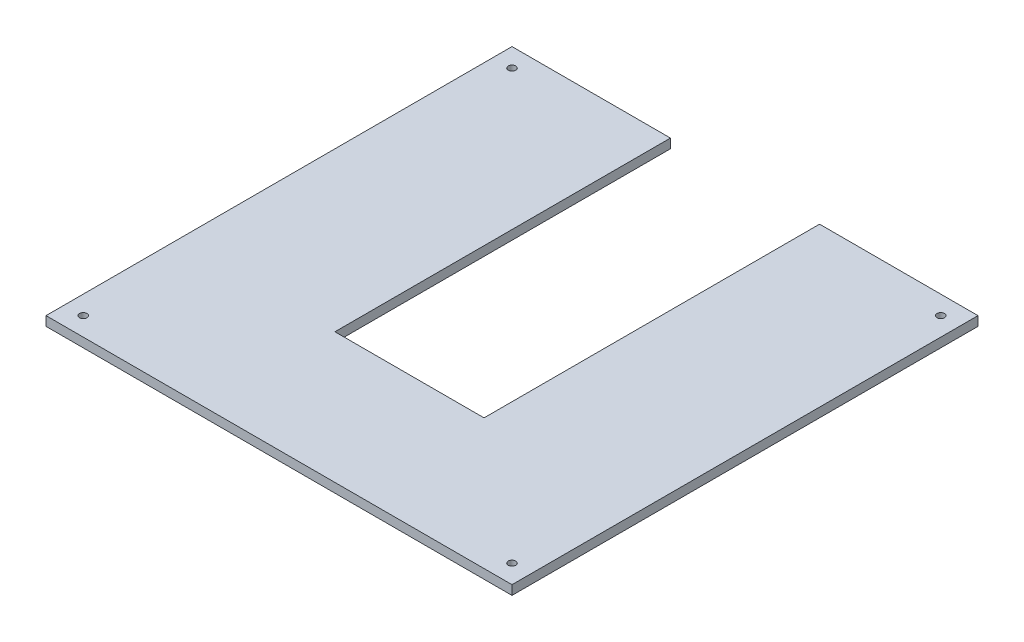
ISO-10303-21;
HEADER;
FILE_DESCRIPTION(('STEP AP214'),'2;1');
FILE_NAME('part.step','',(''),(''),'','','');
FILE_SCHEMA(('AUTOMOTIVE_DESIGN { 1 0 10303 214 1 1 1 1 }'));
ENDSEC;
DATA;
#1=APPLICATION_CONTEXT('core data for automotive mechanical design processes');
#2=APPLICATION_PROTOCOL_DEFINITION('international standard','automotive_design',2000,#1);
#3=PRODUCT_CONTEXT('',#1,'mechanical');
#4=PRODUCT('Part','Part','',(#3));
#5=PRODUCT_RELATED_PRODUCT_CATEGORY('part','',(#4));
#6=PRODUCT_DEFINITION_FORMATION('','',#4);
#7=PRODUCT_DEFINITION_CONTEXT('part definition',#1,'design');
#8=PRODUCT_DEFINITION('design','',#6,#7);
#9=PRODUCT_DEFINITION_SHAPE('','',#8);
#10=(LENGTH_UNIT() NAMED_UNIT(*) SI_UNIT(.MILLI.,.METRE.));
#11=(NAMED_UNIT(*) PLANE_ANGLE_UNIT() SI_UNIT($,.RADIAN.));
#12=(NAMED_UNIT(*) SI_UNIT($,.STERADIAN.) SOLID_ANGLE_UNIT());
#13=UNCERTAINTY_MEASURE_WITH_UNIT(LENGTH_MEASURE(1.E-05),#10,'distance_accuracy_value','');
#14=(GEOMETRIC_REPRESENTATION_CONTEXT(3) GLOBAL_UNCERTAINTY_ASSIGNED_CONTEXT((#13)) GLOBAL_UNIT_ASSIGNED_CONTEXT((#10,
#11,#12)) REPRESENTATION_CONTEXT('',''));
#15=CARTESIAN_POINT('',(0.,0.,0.));
#16=DIRECTION('',(0.,0.,1.));
#17=DIRECTION('',(1.,0.,0.));
#18=AXIS2_PLACEMENT_3D('',#15,#16,#17);
#19=CARTESIAN_POINT('',(0.,5.,0.));
#20=DIRECTION('',(0.,1.,0.));
#21=DIRECTION('',(0.,0.,1.));
#22=AXIS2_PLACEMENT_3D('',#19,#20,#21);
#23=PLANE('',#22);
#24=CARTESIAN_POINT('',(-115.,5.,115.));
#25=DIRECTION('',(0.,1.,0.));
#26=DIRECTION('',(0.,0.,-1.));
#27=AXIS2_PLACEMENT_3D('',#24,#25,#26);
#28=CIRCLE('',#27,2.);
#29=CARTESIAN_POINT('',(-115.,5.,113.));
#30=VERTEX_POINT('',#29);
#31=EDGE_CURVE('E187',#30,#30,#28,.T.);
#32=ORIENTED_EDGE('',*,*,#31,.F.);
#33=EDGE_LOOP('',(#32));
#34=FACE_BOUND('',#33,.T.);
#35=CARTESIAN_POINT('',(-115.,5.,-115.));
#36=DIRECTION('',(0.,1.,0.));
#37=DIRECTION('',(0.,0.,1.));
#38=AXIS2_PLACEMENT_3D('',#35,#36,#37);
#39=CIRCLE('',#38,2.);
#40=CARTESIAN_POINT('',(-115.,5.,-113.));
#41=VERTEX_POINT('',#40);
#42=EDGE_CURVE('E133',#41,#41,#39,.T.);
#43=ORIENTED_EDGE('',*,*,#42,.F.);
#44=EDGE_LOOP('',(#43));
#45=FACE_BOUND('',#44,.T.);
#46=DIRECTION('',(0.,0.,-1.));
#47=VECTOR('',#46,1.);
#48=CARTESIAN_POINT('',(125.,5.,-125.));
#49=LINE('',#48,#47);
#50=CARTESIAN_POINT('',(125.,5.,125.));
#51=VERTEX_POINT('',#50);
#52=CARTESIAN_POINT('',(125.,5.,-125.));
#53=VERTEX_POINT('',#52);
#54=EDGE_CURVE('E144',#51,#53,#49,.T.);
#55=ORIENTED_EDGE('',*,*,#54,.T.);
#56=DIRECTION('',(-1.,0.,0.));
#57=VECTOR('',#56,1.);
#58=CARTESIAN_POINT('',(40.,5.,-125.));
#59=LINE('',#58,#57);
#60=CARTESIAN_POINT('',(40.,5.,-125.));
#61=VERTEX_POINT('',#60);
#62=EDGE_CURVE('E92',#53,#61,#59,.T.);
#63=ORIENTED_EDGE('',*,*,#62,.T.);
#64=DIRECTION('',(0.,0.,1.));
#65=VECTOR('',#64,1.);
#66=CARTESIAN_POINT('',(40.,5.,-125.));
#67=LINE('',#66,#65);
#68=CARTESIAN_POINT('',(40.,5.,55.));
#69=VERTEX_POINT('',#68);
#70=EDGE_CURVE('E159',#61,#69,#67,.T.);
#71=ORIENTED_EDGE('',*,*,#70,.T.);
#72=DIRECTION('',(-1.,0.,0.));
#73=VECTOR('',#72,1.);
#74=CARTESIAN_POINT('',(-40.,5.,55.));
#75=LINE('',#74,#73);
#76=CARTESIAN_POINT('',(-40.,5.,55.));
#77=VERTEX_POINT('',#76);
#78=EDGE_CURVE('E172',#69,#77,#75,.T.);
#79=ORIENTED_EDGE('',*,*,#78,.T.);
#80=DIRECTION('',(0.,0.,-1.));
#81=VECTOR('',#80,1.);
#82=CARTESIAN_POINT('',(-40.,5.,-125.));
#83=LINE('',#82,#81);
#84=CARTESIAN_POINT('',(-40.,5.,-125.));
#85=VERTEX_POINT('',#84);
#86=EDGE_CURVE('E111',#77,#85,#83,.T.);
#87=ORIENTED_EDGE('',*,*,#86,.T.);
#88=DIRECTION('',(-1.,0.,0.));
#89=VECTOR('',#88,1.);
#90=CARTESIAN_POINT('',(-125.,5.,-125.));
#91=LINE('',#90,#89);
#92=CARTESIAN_POINT('',(-125.,5.,-125.));
#93=VERTEX_POINT('',#92);
#94=EDGE_CURVE('E105',#85,#93,#91,.T.);
#95=ORIENTED_EDGE('',*,*,#94,.T.);
#96=DIRECTION('',(0.,0.,1.));
#97=VECTOR('',#96,1.);
#98=CARTESIAN_POINT('',(-125.,5.,-125.));
#99=LINE('',#98,#97);
#100=CARTESIAN_POINT('',(-125.,5.,125.));
#101=VERTEX_POINT('',#100);
#102=EDGE_CURVE('E109',#93,#101,#99,.T.);
#103=ORIENTED_EDGE('',*,*,#102,.T.);
#104=DIRECTION('',(1.,0.,0.));
#105=VECTOR('',#104,1.);
#106=CARTESIAN_POINT('',(-125.,5.,125.));
#107=LINE('',#106,#105);
#108=EDGE_CURVE('E49',#101,#51,#107,.T.);
#109=ORIENTED_EDGE('',*,*,#108,.T.);
#110=EDGE_LOOP('',(#55,#63,#71,#79,#87,#95,#103,#109));
#111=FACE_BOUND('',#110,.T.);
#112=CARTESIAN_POINT('',(115.,5.,-115.));
#113=DIRECTION('',(0.,1.,0.));
#114=DIRECTION('',(0.,0.,-1.));
#115=AXIS2_PLACEMENT_3D('',#112,#113,#114);
#116=CIRCLE('',#115,2.);
#117=CARTESIAN_POINT('',(115.,5.,-117.));
#118=VERTEX_POINT('',#117);
#119=EDGE_CURVE('E181',#118,#118,#116,.T.);
#120=ORIENTED_EDGE('',*,*,#119,.F.);
#121=EDGE_LOOP('',(#120));
#122=FACE_BOUND('',#121,.T.);
#123=CARTESIAN_POINT('',(115.,5.,115.));
#124=DIRECTION('',(0.,1.,0.));
#125=DIRECTION('',(0.,0.,1.));
#126=AXIS2_PLACEMENT_3D('',#123,#124,#125);
#127=CIRCLE('',#126,2.);
#128=CARTESIAN_POINT('',(115.,5.,117.));
#129=VERTEX_POINT('',#128);
#130=EDGE_CURVE('E193',#129,#129,#127,.T.);
#131=ORIENTED_EDGE('',*,*,#130,.F.);
#132=EDGE_LOOP('',(#131));
#133=FACE_BOUND('',#132,.T.);
#134=ADVANCED_FACE('F32',(#34,#45,#111,#122,#133),#23,.T.);
#135=CARTESIAN_POINT('',(0.,0.,0.));
#136=DIRECTION('',(0.,1.,0.));
#137=DIRECTION('',(0.,0.,1.));
#138=AXIS2_PLACEMENT_3D('',#135,#136,#137);
#139=PLANE('',#138);
#140=DIRECTION('',(0.,0.,-1.));
#141=VECTOR('',#140,1.);
#142=CARTESIAN_POINT('',(125.,0.,-125.));
#143=LINE('',#142,#141);
#144=CARTESIAN_POINT('',(125.,0.,125.));
#145=VERTEX_POINT('',#144);
#146=CARTESIAN_POINT('',(125.,0.,-125.));
#147=VERTEX_POINT('',#146);
#148=EDGE_CURVE('E129',#145,#147,#143,.T.);
#149=ORIENTED_EDGE('',*,*,#148,.F.);
#150=DIRECTION('',(1.,0.,0.));
#151=VECTOR('',#150,1.);
#152=CARTESIAN_POINT('',(-125.,0.,125.));
#153=LINE('',#152,#151);
#154=CARTESIAN_POINT('',(-125.,0.,125.));
#155=VERTEX_POINT('',#154);
#156=EDGE_CURVE('E84',#155,#145,#153,.T.);
#157=ORIENTED_EDGE('',*,*,#156,.F.);
#158=DIRECTION('',(0.,0.,1.));
#159=VECTOR('',#158,1.);
#160=CARTESIAN_POINT('',(-125.,0.,-125.));
#161=LINE('',#160,#159);
#162=CARTESIAN_POINT('',(-125.,0.,-125.));
#163=VERTEX_POINT('',#162);
#164=EDGE_CURVE('E78',#163,#155,#161,.T.);
#165=ORIENTED_EDGE('',*,*,#164,.F.);
#166=DIRECTION('',(-1.,0.,0.));
#167=VECTOR('',#166,1.);
#168=CARTESIAN_POINT('',(-125.,0.,-125.));
#169=LINE('',#168,#167);
#170=CARTESIAN_POINT('',(-40.,0.,-125.));
#171=VERTEX_POINT('',#170);
#172=EDGE_CURVE('E119',#171,#163,#169,.T.);
#173=ORIENTED_EDGE('',*,*,#172,.F.);
#174=DIRECTION('',(0.,0.,-1.));
#175=VECTOR('',#174,1.);
#176=CARTESIAN_POINT('',(-40.,0.,-125.));
#177=LINE('',#176,#175);
#178=CARTESIAN_POINT('',(-40.,0.,55.));
#179=VERTEX_POINT('',#178);
#180=EDGE_CURVE('E139',#179,#171,#177,.T.);
#181=ORIENTED_EDGE('',*,*,#180,.F.);
#182=DIRECTION('',(-1.,0.,0.));
#183=VECTOR('',#182,1.);
#184=CARTESIAN_POINT('',(-40.,0.,55.));
#185=LINE('',#184,#183);
#186=CARTESIAN_POINT('',(40.,0.,55.));
#187=VERTEX_POINT('',#186);
#188=EDGE_CURVE('E137',#187,#179,#185,.T.);
#189=ORIENTED_EDGE('',*,*,#188,.F.);
#190=DIRECTION('',(0.,0.,1.));
#191=VECTOR('',#190,1.);
#192=CARTESIAN_POINT('',(40.,0.,-125.));
#193=LINE('',#192,#191);
#194=CARTESIAN_POINT('',(40.,0.,-125.));
#195=VERTEX_POINT('',#194);
#196=EDGE_CURVE('E135',#195,#187,#193,.T.);
#197=ORIENTED_EDGE('',*,*,#196,.F.);
#198=DIRECTION('',(-1.,0.,0.));
#199=VECTOR('',#198,1.);
#200=CARTESIAN_POINT('',(40.,0.,-125.));
#201=LINE('',#200,#199);
#202=EDGE_CURVE('E132',#147,#195,#201,.T.);
#203=ORIENTED_EDGE('',*,*,#202,.F.);
#204=EDGE_LOOP('',(#149,#157,#165,#173,#181,#189,#197,#203));
#205=FACE_BOUND('',#204,.T.);
#206=CARTESIAN_POINT('',(-115.,0.,-115.));
#207=DIRECTION('',(0.,1.,0.));
#208=DIRECTION('',(0.,0.,1.));
#209=AXIS2_PLACEMENT_3D('',#206,#207,#208);
#210=CIRCLE('',#209,2.);
#211=CARTESIAN_POINT('',(-115.,0.,-113.));
#212=VERTEX_POINT('',#211);
#213=EDGE_CURVE('E178',#212,#212,#210,.T.);
#214=ORIENTED_EDGE('',*,*,#213,.T.);
#215=EDGE_LOOP('',(#214));
#216=FACE_BOUND('',#215,.T.);
#217=CARTESIAN_POINT('',(115.,0.,-115.));
#218=DIRECTION('',(0.,1.,0.));
#219=DIRECTION('',(0.,0.,-1.));
#220=AXIS2_PLACEMENT_3D('',#217,#218,#219);
#221=CIRCLE('',#220,2.);
#222=CARTESIAN_POINT('',(115.,0.,-117.));
#223=VERTEX_POINT('',#222);
#224=EDGE_CURVE('E184',#223,#223,#221,.T.);
#225=ORIENTED_EDGE('',*,*,#224,.T.);
#226=EDGE_LOOP('',(#225));
#227=FACE_BOUND('',#226,.T.);
#228=CARTESIAN_POINT('',(-115.,0.,115.));
#229=DIRECTION('',(0.,1.,0.));
#230=DIRECTION('',(0.,0.,-1.));
#231=AXIS2_PLACEMENT_3D('',#228,#229,#230);
#232=CIRCLE('',#231,2.);
#233=CARTESIAN_POINT('',(-115.,0.,113.));
#234=VERTEX_POINT('',#233);
#235=EDGE_CURVE('E190',#234,#234,#232,.T.);
#236=ORIENTED_EDGE('',*,*,#235,.T.);
#237=EDGE_LOOP('',(#236));
#238=FACE_BOUND('',#237,.T.);
#239=CARTESIAN_POINT('',(115.,0.,115.));
#240=DIRECTION('',(0.,1.,0.));
#241=DIRECTION('',(0.,0.,1.));
#242=AXIS2_PLACEMENT_3D('',#239,#240,#241);
#243=CIRCLE('',#242,2.);
#244=CARTESIAN_POINT('',(115.,0.,117.));
#245=VERTEX_POINT('',#244);
#246=EDGE_CURVE('E196',#245,#245,#243,.T.);
#247=ORIENTED_EDGE('',*,*,#246,.T.);
#248=EDGE_LOOP('',(#247));
#249=FACE_BOUND('',#248,.T.);
#250=ADVANCED_FACE('F163',(#205,#216,#227,#238,#249),#139,.F.);
#251=CARTESIAN_POINT('',(125.,5.,-125.));
#252=DIRECTION('',(-1.,0.,0.));
#253=DIRECTION('',(0.,0.,1.));
#254=AXIS2_PLACEMENT_3D('',#251,#252,#253);
#255=PLANE('',#254);
#256=ORIENTED_EDGE('',*,*,#148,.T.);
#257=DIRECTION('',(0.,-1.,0.));
#258=VECTOR('',#257,1.);
#259=CARTESIAN_POINT('',(125.,5.,-125.));
#260=LINE('',#259,#258);
#261=EDGE_CURVE('E11',#53,#147,#260,.T.);
#262=ORIENTED_EDGE('',*,*,#261,.F.);
#263=ORIENTED_EDGE('',*,*,#54,.F.);
#264=DIRECTION('',(0.,-1.,0.));
#265=VECTOR('',#264,1.);
#266=CARTESIAN_POINT('',(125.,5.,125.));
#267=LINE('',#266,#265);
#268=EDGE_CURVE('E125',#51,#145,#267,.T.);
#269=ORIENTED_EDGE('',*,*,#268,.T.);
#270=EDGE_LOOP('',(#256,#262,#263,#269));
#271=FACE_BOUND('',#270,.T.);
#272=ADVANCED_FACE('F34',(#271),#255,.F.);
#273=CARTESIAN_POINT('',(40.,5.,-125.));
#274=DIRECTION('',(0.,0.,1.));
#275=DIRECTION('',(1.,0.,0.));
#276=AXIS2_PLACEMENT_3D('',#273,#274,#275);
#277=PLANE('',#276);
#278=ORIENTED_EDGE('',*,*,#202,.T.);
#279=DIRECTION('',(0.,-1.,0.));
#280=VECTOR('',#279,1.);
#281=CARTESIAN_POINT('',(40.,5.,-125.));
#282=LINE('',#281,#280);
#283=EDGE_CURVE('E41',#61,#195,#282,.T.);
#284=ORIENTED_EDGE('',*,*,#283,.F.);
#285=ORIENTED_EDGE('',*,*,#62,.F.);
#286=ORIENTED_EDGE('',*,*,#261,.T.);
#287=EDGE_LOOP('',(#278,#284,#285,#286));
#288=FACE_BOUND('',#287,.T.);
#289=ADVANCED_FACE('F230',(#288),#277,.F.);
#290=CARTESIAN_POINT('',(40.,5.,-125.));
#291=DIRECTION('',(1.,0.,0.));
#292=DIRECTION('',(0.,0.,-1.));
#293=AXIS2_PLACEMENT_3D('',#290,#291,#292);
#294=PLANE('',#293);
#295=ORIENTED_EDGE('',*,*,#196,.T.);
#296=DIRECTION('',(0.,-1.,0.));
#297=VECTOR('',#296,1.);
#298=CARTESIAN_POINT('',(40.,5.,55.));
#299=LINE('',#298,#297);
#300=EDGE_CURVE('E151',#69,#187,#299,.T.);
#301=ORIENTED_EDGE('',*,*,#300,.F.);
#302=ORIENTED_EDGE('',*,*,#70,.F.);
#303=ORIENTED_EDGE('',*,*,#283,.T.);
#304=EDGE_LOOP('',(#295,#301,#302,#303));
#305=FACE_BOUND('',#304,.T.);
#306=ADVANCED_FACE('F157',(#305),#294,.F.);
#307=CARTESIAN_POINT('',(-40.,5.,55.));
#308=DIRECTION('',(0.,0.,1.));
#309=DIRECTION('',(1.,0.,0.));
#310=AXIS2_PLACEMENT_3D('',#307,#308,#309);
#311=PLANE('',#310);
#312=ORIENTED_EDGE('',*,*,#188,.T.);
#313=DIRECTION('',(0.,-1.,0.));
#314=VECTOR('',#313,1.);
#315=CARTESIAN_POINT('',(-40.,5.,55.));
#316=LINE('',#315,#314);
#317=EDGE_CURVE('E148',#77,#179,#316,.T.);
#318=ORIENTED_EDGE('',*,*,#317,.F.);
#319=ORIENTED_EDGE('',*,*,#78,.F.);
#320=ORIENTED_EDGE('',*,*,#300,.T.);
#321=EDGE_LOOP('',(#312,#318,#319,#320));
#322=FACE_BOUND('',#321,.T.);
#323=ADVANCED_FACE('F168',(#322),#311,.F.);
#324=CARTESIAN_POINT('',(-40.,5.,-125.));
#325=DIRECTION('',(-1.,0.,0.));
#326=DIRECTION('',(0.,0.,1.));
#327=AXIS2_PLACEMENT_3D('',#324,#325,#326);
#328=PLANE('',#327);
#329=ORIENTED_EDGE('',*,*,#180,.T.);
#330=DIRECTION('',(0.,-1.,0.));
#331=VECTOR('',#330,1.);
#332=CARTESIAN_POINT('',(-40.,5.,-125.));
#333=LINE('',#332,#331);
#334=EDGE_CURVE('E120',#85,#171,#333,.T.);
#335=ORIENTED_EDGE('',*,*,#334,.F.);
#336=ORIENTED_EDGE('',*,*,#86,.F.);
#337=ORIENTED_EDGE('',*,*,#317,.T.);
#338=EDGE_LOOP('',(#329,#335,#336,#337));
#339=FACE_BOUND('',#338,.T.);
#340=ADVANCED_FACE('F171',(#339),#328,.F.);
#341=CARTESIAN_POINT('',(-125.,5.,-125.));
#342=DIRECTION('',(0.,0.,1.));
#343=DIRECTION('',(1.,0.,0.));
#344=AXIS2_PLACEMENT_3D('',#341,#342,#343);
#345=PLANE('',#344);
#346=ORIENTED_EDGE('',*,*,#172,.T.);
#347=DIRECTION('',(0.,-1.,0.));
#348=VECTOR('',#347,1.);
#349=CARTESIAN_POINT('',(-125.,5.,-125.));
#350=LINE('',#349,#348);
#351=EDGE_CURVE('E116',#93,#163,#350,.T.);
#352=ORIENTED_EDGE('',*,*,#351,.F.);
#353=ORIENTED_EDGE('',*,*,#94,.F.);
#354=ORIENTED_EDGE('',*,*,#334,.T.);
#355=EDGE_LOOP('',(#346,#352,#353,#354));
#356=FACE_BOUND('',#355,.T.);
#357=ADVANCED_FACE('F117',(#356),#345,.F.);
#358=CARTESIAN_POINT('',(-125.,5.,-125.));
#359=DIRECTION('',(1.,0.,0.));
#360=DIRECTION('',(0.,0.,-1.));
#361=AXIS2_PLACEMENT_3D('',#358,#359,#360);
#362=PLANE('',#361);
#363=ORIENTED_EDGE('',*,*,#164,.T.);
#364=DIRECTION('',(0.,-1.,0.));
#365=VECTOR('',#364,1.);
#366=CARTESIAN_POINT('',(-125.,5.,125.));
#367=LINE('',#366,#365);
#368=EDGE_CURVE('E121',#101,#155,#367,.T.);
#369=ORIENTED_EDGE('',*,*,#368,.F.);
#370=ORIENTED_EDGE('',*,*,#102,.F.);
#371=ORIENTED_EDGE('',*,*,#351,.T.);
#372=EDGE_LOOP('',(#363,#369,#370,#371));
#373=FACE_BOUND('',#372,.T.);
#374=ADVANCED_FACE('F123',(#373),#362,.F.);
#375=CARTESIAN_POINT('',(-125.,5.,125.));
#376=DIRECTION('',(0.,0.,-1.));
#377=DIRECTION('',(-1.,0.,0.));
#378=AXIS2_PLACEMENT_3D('',#375,#376,#377);
#379=PLANE('',#378);
#380=ORIENTED_EDGE('',*,*,#156,.T.);
#381=ORIENTED_EDGE('',*,*,#268,.F.);
#382=ORIENTED_EDGE('',*,*,#108,.F.);
#383=ORIENTED_EDGE('',*,*,#368,.T.);
#384=EDGE_LOOP('',(#380,#381,#382,#383));
#385=FACE_BOUND('',#384,.T.);
#386=ADVANCED_FACE('F218',(#385),#379,.F.);
#387=CARTESIAN_POINT('',(-115.,5.,-115.));
#388=DIRECTION('',(0.,-1.,0.));
#389=DIRECTION('',(0.,0.,-1.));
#390=AXIS2_PLACEMENT_3D('',#387,#388,#389);
#391=CYLINDRICAL_SURFACE('',#390,2.);
#392=ORIENTED_EDGE('',*,*,#42,.T.);
#393=EDGE_LOOP('',(#392));
#394=FACE_BOUND('',#393,.T.);
#395=ORIENTED_EDGE('',*,*,#213,.F.);
#396=EDGE_LOOP('',(#395));
#397=FACE_BOUND('',#396,.T.);
#398=ADVANCED_FACE('F215',(#394,#397),#391,.F.);
#399=CARTESIAN_POINT('',(115.,5.,-115.));
#400=DIRECTION('',(0.,-1.,0.));
#401=DIRECTION('',(0.,0.,-1.));
#402=AXIS2_PLACEMENT_3D('',#399,#400,#401);
#403=CYLINDRICAL_SURFACE('',#402,2.);
#404=ORIENTED_EDGE('',*,*,#119,.T.);
#405=EDGE_LOOP('',(#404));
#406=FACE_BOUND('',#405,.T.);
#407=ORIENTED_EDGE('',*,*,#224,.F.);
#408=EDGE_LOOP('',(#407));
#409=FACE_BOUND('',#408,.T.);
#410=ADVANCED_FACE('F294',(#406,#409),#403,.F.);
#411=CARTESIAN_POINT('',(-115.,5.,115.));
#412=DIRECTION('',(0.,-1.,0.));
#413=DIRECTION('',(0.,0.,-1.));
#414=AXIS2_PLACEMENT_3D('',#411,#412,#413);
#415=CYLINDRICAL_SURFACE('',#414,2.);
#416=ORIENTED_EDGE('',*,*,#31,.T.);
#417=EDGE_LOOP('',(#416));
#418=FACE_BOUND('',#417,.T.);
#419=ORIENTED_EDGE('',*,*,#235,.F.);
#420=EDGE_LOOP('',(#419));
#421=FACE_BOUND('',#420,.T.);
#422=ADVANCED_FACE('F302',(#418,#421),#415,.F.);
#423=CARTESIAN_POINT('',(115.,5.,115.));
#424=DIRECTION('',(0.,-1.,0.));
#425=DIRECTION('',(0.,0.,-1.));
#426=AXIS2_PLACEMENT_3D('',#423,#424,#425);
#427=CYLINDRICAL_SURFACE('',#426,2.);
#428=ORIENTED_EDGE('',*,*,#130,.T.);
#429=EDGE_LOOP('',(#428));
#430=FACE_BOUND('',#429,.T.);
#431=ORIENTED_EDGE('',*,*,#246,.F.);
#432=EDGE_LOOP('',(#431));
#433=FACE_BOUND('',#432,.T.);
#434=ADVANCED_FACE('F202',(#430,#433),#427,.F.);
#435=CLOSED_SHELL('',(#134,#250,#272,#289,#306,#323,#340,#357,#374,#386,#398,#410,#422,#434));
#436=MANIFOLD_SOLID_BREP('B2',#435);
#437=ADVANCED_BREP_SHAPE_REPRESENTATION('',(#18,#436),#14);
#438=SHAPE_DEFINITION_REPRESENTATION(#9,#437);
ENDSEC;
END-ISO-10303-21;
